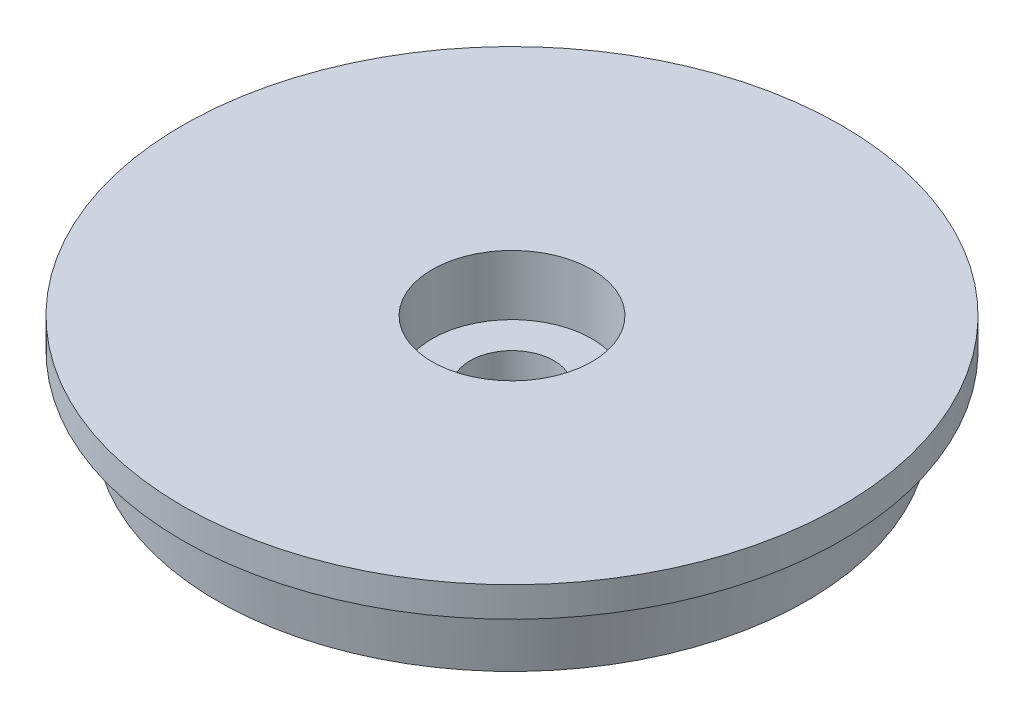
ISO-10303-21;
HEADER;
FILE_DESCRIPTION(('STEP AP214'),'2;1');
FILE_NAME('part.step','',(''),(''),'','','');
FILE_SCHEMA(('AUTOMOTIVE_DESIGN { 1 0 10303 214 1 1 1 1 }'));
ENDSEC;
DATA;
#1=APPLICATION_CONTEXT('core data for automotive mechanical design processes');
#2=APPLICATION_PROTOCOL_DEFINITION('international standard','automotive_design',2000,#1);
#3=PRODUCT_CONTEXT('',#1,'mechanical');
#4=PRODUCT('Part','Part','',(#3));
#5=PRODUCT_RELATED_PRODUCT_CATEGORY('part','',(#4));
#6=PRODUCT_DEFINITION_FORMATION('','',#4);
#7=PRODUCT_DEFINITION_CONTEXT('part definition',#1,'design');
#8=PRODUCT_DEFINITION('design','',#6,#7);
#9=PRODUCT_DEFINITION_SHAPE('','',#8);
#10=(LENGTH_UNIT() NAMED_UNIT(*) SI_UNIT(.MILLI.,.METRE.));
#11=(NAMED_UNIT(*) PLANE_ANGLE_UNIT() SI_UNIT($,.RADIAN.));
#12=(NAMED_UNIT(*) SI_UNIT($,.STERADIAN.) SOLID_ANGLE_UNIT());
#13=UNCERTAINTY_MEASURE_WITH_UNIT(LENGTH_MEASURE(1.E-05),#10,'distance_accuracy_value','');
#14=(GEOMETRIC_REPRESENTATION_CONTEXT(3) GLOBAL_UNCERTAINTY_ASSIGNED_CONTEXT((#13)) GLOBAL_UNIT_ASSIGNED_CONTEXT((#10,
#11,#12)) REPRESENTATION_CONTEXT('',''));
#15=CARTESIAN_POINT('',(0.,0.,0.));
#16=DIRECTION('',(0.,0.,1.));
#17=DIRECTION('',(1.,0.,0.));
#18=AXIS2_PLACEMENT_3D('',#15,#16,#17);
#19=CARTESIAN_POINT('',(0.,0.,-14.75));
#20=DIRECTION('',(0.,-1.,0.));
#21=DIRECTION('',(0.,0.,-1.));
#22=AXIS2_PLACEMENT_3D('',#19,#20,#21);
#23=PLANE('',#22);
#24=CARTESIAN_POINT('',(0.,0.,0.));
#25=DIRECTION('',(0.,-1.,0.));
#26=DIRECTION('',(0.,0.,-1.));
#27=AXIS2_PLACEMENT_3D('',#24,#25,#26);
#28=CIRCLE('',#27,14.75);
#29=CARTESIAN_POINT('',(0.,0.,-14.75));
#30=VERTEX_POINT('',#29);
#31=EDGE_CURVE('E65',#30,#30,#28,.T.);
#32=ORIENTED_EDGE('',*,*,#31,.T.);
#33=EDGE_LOOP('',(#32));
#34=FACE_BOUND('',#33,.T.);
#35=CARTESIAN_POINT('',(0.,0.,0.));
#36=DIRECTION('',(0.,-1.,0.));
#37=DIRECTION('',(0.,0.,-1.));
#38=AXIS2_PLACEMENT_3D('',#35,#36,#37);
#39=CIRCLE('',#38,2.1);
#40=CARTESIAN_POINT('',(0.,0.,-2.1));
#41=VERTEX_POINT('',#40);
#42=EDGE_CURVE('E10',#41,#41,#39,.T.);
#43=ORIENTED_EDGE('',*,*,#42,.F.);
#44=EDGE_LOOP('',(#43));
#45=FACE_BOUND('',#44,.T.);
#46=ADVANCED_FACE('F37',(#34,#45),#23,.T.);
#47=CARTESIAN_POINT('',(0.,0.,0.));
#48=DIRECTION('',(0.,-1.,0.));
#49=DIRECTION('',(0.,0.,-1.));
#50=AXIS2_PLACEMENT_3D('',#47,#48,#49);
#51=CYLINDRICAL_SURFACE('',#50,2.1);
#52=ORIENTED_EDGE('',*,*,#42,.T.);
#53=EDGE_LOOP('',(#52));
#54=FACE_BOUND('',#53,.T.);
#55=CARTESIAN_POINT('',(0.,2.,0.));
#56=DIRECTION('',(0.,-1.,0.));
#57=DIRECTION('',(0.,0.,-1.));
#58=AXIS2_PLACEMENT_3D('',#55,#56,#57);
#59=CIRCLE('',#58,2.1);
#60=CARTESIAN_POINT('',(0.,2.,-2.1));
#61=VERTEX_POINT('',#60);
#62=EDGE_CURVE('E43',#61,#61,#59,.T.);
#63=ORIENTED_EDGE('',*,*,#62,.F.);
#64=EDGE_LOOP('',(#63));
#65=FACE_BOUND('',#64,.T.);
#66=ADVANCED_FACE('F83',(#54,#65),#51,.F.);
#67=CARTESIAN_POINT('',(0.,2.,-2.1));
#68=DIRECTION('',(0.,1.,0.));
#69=DIRECTION('',(0.,0.,1.));
#70=AXIS2_PLACEMENT_3D('',#67,#68,#69);
#71=PLANE('',#70);
#72=ORIENTED_EDGE('',*,*,#62,.T.);
#73=EDGE_LOOP('',(#72));
#74=FACE_BOUND('',#73,.T.);
#75=CARTESIAN_POINT('',(0.,2.,0.));
#76=DIRECTION('',(0.,-1.,0.));
#77=DIRECTION('',(0.,0.,-1.));
#78=AXIS2_PLACEMENT_3D('',#75,#76,#77);
#79=CIRCLE('',#78,4.);
#80=CARTESIAN_POINT('',(0.,2.,-4.));
#81=VERTEX_POINT('',#80);
#82=EDGE_CURVE('E47',#81,#81,#79,.T.);
#83=ORIENTED_EDGE('',*,*,#82,.F.);
#84=EDGE_LOOP('',(#83));
#85=FACE_BOUND('',#84,.T.);
#86=ADVANCED_FACE('F87',(#74,#85),#71,.T.);
#87=CARTESIAN_POINT('',(0.,0.,0.));
#88=DIRECTION('',(0.,-1.,0.));
#89=DIRECTION('',(0.,0.,-1.));
#90=AXIS2_PLACEMENT_3D('',#87,#88,#89);
#91=CYLINDRICAL_SURFACE('',#90,4.);
#92=ORIENTED_EDGE('',*,*,#82,.T.);
#93=EDGE_LOOP('',(#92));
#94=FACE_BOUND('',#93,.T.);
#95=CARTESIAN_POINT('',(0.,5.,0.));
#96=DIRECTION('',(0.,-1.,0.));
#97=DIRECTION('',(0.,0.,-1.));
#98=AXIS2_PLACEMENT_3D('',#95,#96,#97);
#99=CIRCLE('',#98,4.);
#100=CARTESIAN_POINT('',(0.,5.,-4.));
#101=VERTEX_POINT('',#100);
#102=EDGE_CURVE('E51',#101,#101,#99,.T.);
#103=ORIENTED_EDGE('',*,*,#102,.F.);
#104=EDGE_LOOP('',(#103));
#105=FACE_BOUND('',#104,.T.);
#106=ADVANCED_FACE('F91',(#94,#105),#91,.F.);
#107=CARTESIAN_POINT('',(0.,5.,-4.));
#108=DIRECTION('',(0.,1.,0.));
#109=DIRECTION('',(0.,0.,1.));
#110=AXIS2_PLACEMENT_3D('',#107,#108,#109);
#111=PLANE('',#110);
#112=ORIENTED_EDGE('',*,*,#102,.T.);
#113=EDGE_LOOP('',(#112));
#114=FACE_BOUND('',#113,.T.);
#115=CARTESIAN_POINT('',(0.,5.,0.));
#116=DIRECTION('',(0.,-1.,0.));
#117=DIRECTION('',(0.,0.,-1.));
#118=AXIS2_PLACEMENT_3D('',#115,#116,#117);
#119=CIRCLE('',#118,16.5);
#120=CARTESIAN_POINT('',(0.,5.,-16.5));
#121=VERTEX_POINT('',#120);
#122=EDGE_CURVE('E56',#121,#121,#119,.T.);
#123=ORIENTED_EDGE('',*,*,#122,.F.);
#124=EDGE_LOOP('',(#123));
#125=FACE_BOUND('',#124,.T.);
#126=ADVANCED_FACE('F97',(#114,#125),#111,.T.);
#127=CARTESIAN_POINT('',(0.,0.,0.));
#128=DIRECTION('',(0.,-1.,0.));
#129=DIRECTION('',(0.,0.,-1.));
#130=AXIS2_PLACEMENT_3D('',#127,#128,#129);
#131=CYLINDRICAL_SURFACE('',#130,16.5);
#132=ORIENTED_EDGE('',*,*,#122,.T.);
#133=EDGE_LOOP('',(#132));
#134=FACE_BOUND('',#133,.T.);
#135=CARTESIAN_POINT('',(0.,3.5,0.));
#136=DIRECTION('',(0.,-1.,0.));
#137=DIRECTION('',(0.,0.,-1.));
#138=AXIS2_PLACEMENT_3D('',#135,#136,#137);
#139=CIRCLE('',#138,16.5);
#140=CARTESIAN_POINT('',(0.,3.5,-16.5));
#141=VERTEX_POINT('',#140);
#142=EDGE_CURVE('E59',#141,#141,#139,.T.);
#143=ORIENTED_EDGE('',*,*,#142,.F.);
#144=EDGE_LOOP('',(#143));
#145=FACE_BOUND('',#144,.T.);
#146=ADVANCED_FACE('F79',(#134,#145),#131,.T.);
#147=CARTESIAN_POINT('',(0.,3.5,-16.5));
#148=DIRECTION('',(0.,-1.,0.));
#149=DIRECTION('',(0.,0.,-1.));
#150=AXIS2_PLACEMENT_3D('',#147,#148,#149);
#151=PLANE('',#150);
#152=ORIENTED_EDGE('',*,*,#142,.T.);
#153=EDGE_LOOP('',(#152));
#154=FACE_BOUND('',#153,.T.);
#155=CARTESIAN_POINT('',(0.,3.5,0.));
#156=DIRECTION('',(0.,-1.,0.));
#157=DIRECTION('',(0.,0.,-1.));
#158=AXIS2_PLACEMENT_3D('',#155,#156,#157);
#159=CIRCLE('',#158,15.1);
#160=CARTESIAN_POINT('',(0.,3.5,-15.1));
#161=VERTEX_POINT('',#160);
#162=EDGE_CURVE('E62',#161,#161,#159,.T.);
#163=ORIENTED_EDGE('',*,*,#162,.F.);
#164=EDGE_LOOP('',(#163));
#165=FACE_BOUND('',#164,.T.);
#166=ADVANCED_FACE('F73',(#154,#165),#151,.T.);
#167=CARTESIAN_POINT('',(0.,0.,0.));
#168=DIRECTION('',(0.,1.,0.));
#169=DIRECTION('',(0.,0.,1.));
#170=AXIS2_PLACEMENT_3D('',#167,#168,#169);
#171=CONICAL_SURFACE('',#170,14.75,0.099668652491162);
#172=ORIENTED_EDGE('',*,*,#162,.T.);
#173=EDGE_LOOP('',(#172));
#174=FACE_BOUND('',#173,.T.);
#175=ORIENTED_EDGE('',*,*,#31,.F.);
#176=EDGE_LOOP('',(#175));
#177=FACE_BOUND('',#176,.T.);
#178=ADVANCED_FACE('F71',(#174,#177),#171,.T.);
#179=CLOSED_SHELL('',(#46,#66,#86,#106,#126,#146,#166,#178));
#180=MANIFOLD_SOLID_BREP('B2',#179);
#181=ADVANCED_BREP_SHAPE_REPRESENTATION('',(#18,#180),#14);
#182=SHAPE_DEFINITION_REPRESENTATION(#9,#181);
ENDSEC;
END-ISO-10303-21;
